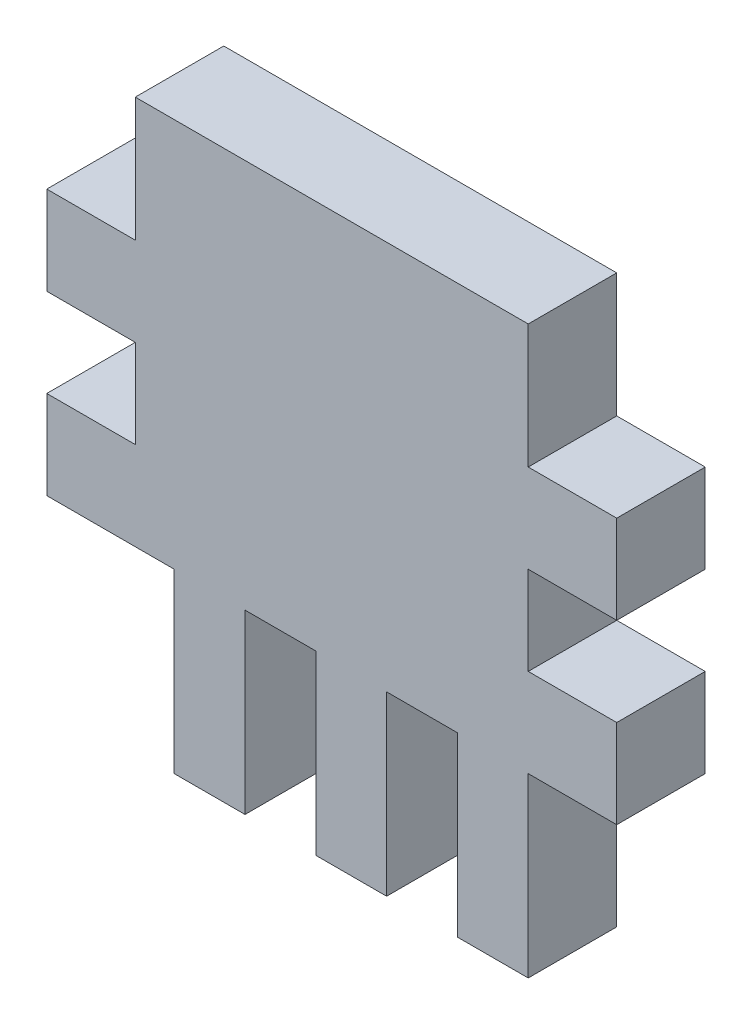
ISO-10303-21;
HEADER;
FILE_DESCRIPTION(('STEP AP214'),'2;1');
FILE_NAME('part.step','',(''),(''),'','','');
FILE_SCHEMA(('AUTOMOTIVE_DESIGN { 1 0 10303 214 1 1 1 1 }'));
ENDSEC;
DATA;
#1=APPLICATION_CONTEXT('core data for automotive mechanical design processes');
#2=APPLICATION_PROTOCOL_DEFINITION('international standard','automotive_design',2000,#1);
#3=PRODUCT_CONTEXT('',#1,'mechanical');
#4=PRODUCT('Part','Part','',(#3));
#5=PRODUCT_RELATED_PRODUCT_CATEGORY('part','',(#4));
#6=PRODUCT_DEFINITION_FORMATION('','',#4);
#7=PRODUCT_DEFINITION_CONTEXT('part definition',#1,'design');
#8=PRODUCT_DEFINITION('design','',#6,#7);
#9=PRODUCT_DEFINITION_SHAPE('','',#8);
#10=(LENGTH_UNIT() NAMED_UNIT(*) SI_UNIT(.MILLI.,.METRE.));
#11=(NAMED_UNIT(*) PLANE_ANGLE_UNIT() SI_UNIT($,.RADIAN.));
#12=(NAMED_UNIT(*) SI_UNIT($,.STERADIAN.) SOLID_ANGLE_UNIT());
#13=UNCERTAINTY_MEASURE_WITH_UNIT(LENGTH_MEASURE(1.E-05),#10,'distance_accuracy_value','');
#14=(GEOMETRIC_REPRESENTATION_CONTEXT(3) GLOBAL_UNCERTAINTY_ASSIGNED_CONTEXT((#13)) GLOBAL_UNIT_ASSIGNED_CONTEXT((#10,
#11,#12)) REPRESENTATION_CONTEXT('',''));
#15=CARTESIAN_POINT('',(0.,0.,0.));
#16=DIRECTION('',(0.,0.,1.));
#17=DIRECTION('',(1.,0.,0.));
#18=AXIS2_PLACEMENT_3D('',#15,#16,#17);
#19=CARTESIAN_POINT('',(7.56053151531805,0.,5.));
#20=DIRECTION('',(1.,0.,0.));
#21=DIRECTION('',(0.,1.,0.));
#22=AXIS2_PLACEMENT_3D('',#19,#20,#21);
#23=PLANE('',#22);
#24=DIRECTION('',(0.,-1.,0.));
#25=VECTOR('',#24,1.);
#26=CARTESIAN_POINT('',(7.56053151531805,0.,0.));
#27=LINE('',#26,#25);
#28=CARTESIAN_POINT('',(7.56053151531805,-1.21306122857178,0.));
#29=VERTEX_POINT('',#28);
#30=CARTESIAN_POINT('',(7.56053151531805,-11.2130612285718,0.));
#31=VERTEX_POINT('',#30);
#32=EDGE_CURVE('E450',#29,#31,#27,.T.);
#33=ORIENTED_EDGE('',*,*,#32,.F.);
#34=DIRECTION('',(0.,0.,-1.));
#35=VECTOR('',#34,1.);
#36=CARTESIAN_POINT('',(7.56053151531805,-1.21306122857178,5.));
#37=LINE('',#36,#35);
#38=CARTESIAN_POINT('',(7.56053151531805,-1.21306122857178,5.));
#39=VERTEX_POINT('',#38);
#40=EDGE_CURVE('E405',#39,#29,#37,.T.);
#41=ORIENTED_EDGE('',*,*,#40,.F.);
#42=DIRECTION('',(0.,-1.,0.));
#43=VECTOR('',#42,1.);
#44=CARTESIAN_POINT('',(7.56053151531805,0.,5.));
#45=LINE('',#44,#43);
#46=CARTESIAN_POINT('',(7.56053151531805,-11.2130612285718,5.));
#47=VERTEX_POINT('',#46);
#48=EDGE_CURVE('E526',#39,#47,#45,.T.);
#49=ORIENTED_EDGE('',*,*,#48,.T.);
#50=DIRECTION('',(0.,0.,-1.));
#51=VECTOR('',#50,1.);
#52=CARTESIAN_POINT('',(7.56053151531805,-11.2130612285718,5.));
#53=LINE('',#52,#51);
#54=EDGE_CURVE('E407',#47,#31,#53,.T.);
#55=ORIENTED_EDGE('',*,*,#54,.T.);
#56=EDGE_LOOP('',(#33,#41,#49,#55));
#57=FACE_BOUND('',#56,.T.);
#58=ADVANCED_FACE('F130',(#57),#23,.T.);
#59=CARTESIAN_POINT('',(0.,-11.2130612285718,5.));
#60=DIRECTION('',(0.,1.,0.));
#61=DIRECTION('',(0.,0.,1.));
#62=AXIS2_PLACEMENT_3D('',#59,#60,#61);
#63=PLANE('',#62);
#64=DIRECTION('',(1.,0.,0.));
#65=VECTOR('',#64,1.);
#66=CARTESIAN_POINT('',(0.,-11.2130612285718,0.));
#67=LINE('',#66,#65);
#68=CARTESIAN_POINT('',(3.56053151531805,-11.2130612285718,0.));
#69=VERTEX_POINT('',#68);
#70=EDGE_CURVE('E447',#69,#31,#67,.T.);
#71=ORIENTED_EDGE('',*,*,#70,.T.);
#72=ORIENTED_EDGE('',*,*,#54,.F.);
#73=DIRECTION('',(1.,0.,0.));
#74=VECTOR('',#73,1.);
#75=CARTESIAN_POINT('',(0.,-11.2130612285718,5.));
#76=LINE('',#75,#74);
#77=CARTESIAN_POINT('',(3.56053151531805,-11.2130612285718,5.));
#78=VERTEX_POINT('',#77);
#79=EDGE_CURVE('E529',#78,#47,#76,.T.);
#80=ORIENTED_EDGE('',*,*,#79,.F.);
#81=DIRECTION('',(0.,0.,-1.));
#82=VECTOR('',#81,1.);
#83=CARTESIAN_POINT('',(3.56053151531805,-11.2130612285718,5.));
#84=LINE('',#83,#82);
#85=EDGE_CURVE('E409',#78,#69,#84,.T.);
#86=ORIENTED_EDGE('',*,*,#85,.T.);
#87=EDGE_LOOP('',(#71,#72,#80,#86));
#88=FACE_BOUND('',#87,.T.);
#89=ADVANCED_FACE('F558',(#88),#63,.F.);
#90=CARTESIAN_POINT('',(3.56053151531805,0.,5.));
#91=DIRECTION('',(1.,0.,0.));
#92=DIRECTION('',(0.,1.,0.));
#93=AXIS2_PLACEMENT_3D('',#90,#91,#92);
#94=PLANE('',#93);
#95=DIRECTION('',(0.,-1.,0.));
#96=VECTOR('',#95,1.);
#97=CARTESIAN_POINT('',(3.56053151531805,0.,0.));
#98=LINE('',#97,#96);
#99=CARTESIAN_POINT('',(3.56053151531805,-1.21306122857178,0.));
#100=VERTEX_POINT('',#99);
#101=EDGE_CURVE('E443',#100,#69,#98,.T.);
#102=ORIENTED_EDGE('',*,*,#101,.T.);
#103=ORIENTED_EDGE('',*,*,#85,.F.);
#104=DIRECTION('',(0.,-1.,0.));
#105=VECTOR('',#104,1.);
#106=CARTESIAN_POINT('',(3.56053151531805,0.,5.));
#107=LINE('',#106,#105);
#108=CARTESIAN_POINT('',(3.56053151531805,-1.21306122857178,5.));
#109=VERTEX_POINT('',#108);
#110=EDGE_CURVE('E531',#109,#78,#107,.T.);
#111=ORIENTED_EDGE('',*,*,#110,.F.);
#112=DIRECTION('',(0.,0.,-1.));
#113=VECTOR('',#112,1.);
#114=CARTESIAN_POINT('',(3.56053151531805,-1.21306122857178,5.));
#115=LINE('',#114,#113);
#116=EDGE_CURVE('E412',#109,#100,#115,.T.);
#117=ORIENTED_EDGE('',*,*,#116,.T.);
#118=EDGE_LOOP('',(#102,#103,#111,#117));
#119=FACE_BOUND('',#118,.T.);
#120=ADVANCED_FACE('F552',(#119),#94,.F.);
#121=CARTESIAN_POINT('',(11.5605315153181,0.,5.));
#122=DIRECTION('',(1.,0.,0.));
#123=DIRECTION('',(0.,1.,0.));
#124=AXIS2_PLACEMENT_3D('',#121,#122,#123);
#125=PLANE('',#124);
#126=DIRECTION('',(0.,-1.,0.));
#127=VECTOR('',#126,1.);
#128=CARTESIAN_POINT('',(11.5605315153181,0.,0.));
#129=LINE('',#128,#127);
#130=CARTESIAN_POINT('',(11.5605315153181,-1.21306122857178,0.));
#131=VERTEX_POINT('',#130);
#132=CARTESIAN_POINT('',(11.5605315153181,-11.2130612285718,0.));
#133=VERTEX_POINT('',#132);
#134=EDGE_CURVE('E453',#131,#133,#129,.T.);
#135=ORIENTED_EDGE('',*,*,#134,.T.);
#136=DIRECTION('',(0.,0.,-1.));
#137=VECTOR('',#136,1.);
#138=CARTESIAN_POINT('',(11.5605315153181,-11.2130612285718,5.));
#139=LINE('',#138,#137);
#140=CARTESIAN_POINT('',(11.5605315153181,-11.2130612285718,5.));
#141=VERTEX_POINT('',#140);
#142=EDGE_CURVE('E399',#141,#133,#139,.T.);
#143=ORIENTED_EDGE('',*,*,#142,.F.);
#144=DIRECTION('',(0.,-1.,0.));
#145=VECTOR('',#144,1.);
#146=CARTESIAN_POINT('',(11.5605315153181,0.,5.));
#147=LINE('',#146,#145);
#148=CARTESIAN_POINT('',(11.5605315153181,-1.21306122857178,5.));
#149=VERTEX_POINT('',#148);
#150=EDGE_CURVE('E523',#149,#141,#147,.T.);
#151=ORIENTED_EDGE('',*,*,#150,.F.);
#152=DIRECTION('',(0.,0.,-1.));
#153=VECTOR('',#152,1.);
#154=CARTESIAN_POINT('',(11.5605315153181,-1.21306122857178,5.));
#155=LINE('',#154,#153);
#156=EDGE_CURVE('E402',#149,#131,#155,.T.);
#157=ORIENTED_EDGE('',*,*,#156,.T.);
#158=EDGE_LOOP('',(#135,#143,#151,#157));
#159=FACE_BOUND('',#158,.T.);
#160=ADVANCED_FACE('F625',(#159),#125,.F.);
#161=CARTESIAN_POINT('',(0.,-11.2130612285718,5.));
#162=DIRECTION('',(0.,1.,0.));
#163=DIRECTION('',(0.,0.,1.));
#164=AXIS2_PLACEMENT_3D('',#161,#162,#163);
#165=PLANE('',#164);
#166=DIRECTION('',(1.,0.,0.));
#167=VECTOR('',#166,1.);
#168=CARTESIAN_POINT('',(0.,-11.2130612285718,0.));
#169=LINE('',#168,#167);
#170=CARTESIAN_POINT('',(15.5605315153181,-11.2130612285718,0.));
#171=VERTEX_POINT('',#170);
#172=EDGE_CURVE('E455',#133,#171,#169,.T.);
#173=ORIENTED_EDGE('',*,*,#172,.T.);
#174=DIRECTION('',(0.,0.,-1.));
#175=VECTOR('',#174,1.);
#176=CARTESIAN_POINT('',(15.5605315153181,-11.2130612285718,5.));
#177=LINE('',#176,#175);
#178=CARTESIAN_POINT('',(15.5605315153181,-11.2130612285718,5.));
#179=VERTEX_POINT('',#178);
#180=EDGE_CURVE('E397',#179,#171,#177,.T.);
#181=ORIENTED_EDGE('',*,*,#180,.F.);
#182=DIRECTION('',(1.,0.,0.));
#183=VECTOR('',#182,1.);
#184=CARTESIAN_POINT('',(0.,-11.2130612285718,5.));
#185=LINE('',#184,#183);
#186=EDGE_CURVE('E521',#141,#179,#185,.T.);
#187=ORIENTED_EDGE('',*,*,#186,.F.);
#188=ORIENTED_EDGE('',*,*,#142,.T.);
#189=EDGE_LOOP('',(#173,#181,#187,#188));
#190=FACE_BOUND('',#189,.T.);
#191=ADVANCED_FACE('F627',(#190),#165,.F.);
#192=CARTESIAN_POINT('',(15.5605315153181,0.,5.));
#193=DIRECTION('',(1.,0.,0.));
#194=DIRECTION('',(0.,1.,0.));
#195=AXIS2_PLACEMENT_3D('',#192,#193,#194);
#196=PLANE('',#195);
#197=DIRECTION('',(0.,-1.,0.));
#198=VECTOR('',#197,1.);
#199=CARTESIAN_POINT('',(15.5605315153181,0.,0.));
#200=LINE('',#199,#198);
#201=CARTESIAN_POINT('',(15.5605315153181,-1.21306122857178,0.));
#202=VERTEX_POINT('',#201);
#203=EDGE_CURVE('E458',#202,#171,#200,.T.);
#204=ORIENTED_EDGE('',*,*,#203,.F.);
#205=DIRECTION('',(0.,0.,-1.));
#206=VECTOR('',#205,1.);
#207=CARTESIAN_POINT('',(15.5605315153181,-1.21306122857178,5.));
#208=LINE('',#207,#206);
#209=CARTESIAN_POINT('',(15.5605315153181,-1.21306122857178,5.));
#210=VERTEX_POINT('',#209);
#211=EDGE_CURVE('E395',#210,#202,#208,.T.);
#212=ORIENTED_EDGE('',*,*,#211,.F.);
#213=DIRECTION('',(0.,-1.,0.));
#214=VECTOR('',#213,1.);
#215=CARTESIAN_POINT('',(15.5605315153181,0.,5.));
#216=LINE('',#215,#214);
#217=EDGE_CURVE('E518',#210,#179,#216,.T.);
#218=ORIENTED_EDGE('',*,*,#217,.T.);
#219=ORIENTED_EDGE('',*,*,#180,.T.);
#220=EDGE_LOOP('',(#204,#212,#218,#219));
#221=FACE_BOUND('',#220,.T.);
#222=ADVANCED_FACE('F634',(#221),#196,.T.);
#223=CARTESIAN_POINT('',(0.,-1.21306122857178,5.));
#224=DIRECTION('',(0.,1.,0.));
#225=DIRECTION('',(0.,0.,1.));
#226=AXIS2_PLACEMENT_3D('',#223,#224,#225);
#227=PLANE('',#226);
#228=DIRECTION('',(1.,0.,0.));
#229=VECTOR('',#228,1.);
#230=CARTESIAN_POINT('',(0.,-1.21306122857178,0.));
#231=LINE('',#230,#229);
#232=CARTESIAN_POINT('',(19.5605315153181,-1.21306122857178,0.));
#233=VERTEX_POINT('',#232);
#234=EDGE_CURVE('E444',#202,#233,#231,.T.);
#235=ORIENTED_EDGE('',*,*,#234,.T.);
#236=DIRECTION('',(0.,0.,-1.));
#237=VECTOR('',#236,1.);
#238=CARTESIAN_POINT('',(19.5605315153181,-1.21306122857178,5.));
#239=LINE('',#238,#237);
#240=CARTESIAN_POINT('',(19.5605315153181,-1.21306122857178,5.));
#241=VERTEX_POINT('',#240);
#242=EDGE_CURVE('E392',#241,#233,#239,.T.);
#243=ORIENTED_EDGE('',*,*,#242,.F.);
#244=DIRECTION('',(1.,0.,0.));
#245=VECTOR('',#244,1.);
#246=CARTESIAN_POINT('',(0.,-1.21306122857178,5.));
#247=LINE('',#246,#245);
#248=EDGE_CURVE('E517',#210,#241,#247,.T.);
#249=ORIENTED_EDGE('',*,*,#248,.F.);
#250=ORIENTED_EDGE('',*,*,#211,.T.);
#251=EDGE_LOOP('',(#235,#243,#249,#250));
#252=FACE_BOUND('',#251,.T.);
#253=ADVANCED_FACE('F573',(#252),#227,.F.);
#254=CARTESIAN_POINT('',(19.5605315153181,0.,5.));
#255=DIRECTION('',(1.,0.,0.));
#256=DIRECTION('',(0.,0.,-1.));
#257=AXIS2_PLACEMENT_3D('',#254,#255,#256);
#258=PLANE('',#257);
#259=DIRECTION('',(0.,-1.,0.));
#260=VECTOR('',#259,1.);
#261=CARTESIAN_POINT('',(19.5605315153181,0.,0.));
#262=LINE('',#261,#260);
#263=CARTESIAN_POINT('',(19.5605315153181,-11.2130612285718,0.));
#264=VERTEX_POINT('',#263);
#265=EDGE_CURVE('E461',#233,#264,#262,.T.);
#266=ORIENTED_EDGE('',*,*,#265,.T.);
#267=DIRECTION('',(0.,0.,-1.));
#268=VECTOR('',#267,1.);
#269=CARTESIAN_POINT('',(19.5605315153181,-11.2130612285718,5.));
#270=LINE('',#269,#268);
#271=CARTESIAN_POINT('',(19.5605315153181,-11.2130612285718,5.));
#272=VERTEX_POINT('',#271);
#273=EDGE_CURVE('E390',#272,#264,#270,.T.);
#274=ORIENTED_EDGE('',*,*,#273,.F.);
#275=DIRECTION('',(0.,-1.,0.));
#276=VECTOR('',#275,1.);
#277=CARTESIAN_POINT('',(19.5605315153181,0.,5.));
#278=LINE('',#277,#276);
#279=EDGE_CURVE('E515',#241,#272,#278,.T.);
#280=ORIENTED_EDGE('',*,*,#279,.F.);
#281=ORIENTED_EDGE('',*,*,#242,.T.);
#282=EDGE_LOOP('',(#266,#274,#280,#281));
#283=FACE_BOUND('',#282,.T.);
#284=ADVANCED_FACE('F577',(#283),#258,.F.);
#285=CARTESIAN_POINT('',(0.,-11.2130612285718,5.));
#286=DIRECTION('',(0.,-1.,0.));
#287=DIRECTION('',(1.,0.,0.));
#288=AXIS2_PLACEMENT_3D('',#285,#286,#287);
#289=PLANE('',#288);
#290=DIRECTION('',(-1.,0.,0.));
#291=VECTOR('',#290,1.);
#292=CARTESIAN_POINT('',(0.,-11.2130612285718,0.));
#293=LINE('',#292,#291);
#294=CARTESIAN_POINT('',(23.5605315153181,-11.2130612285718,0.));
#295=VERTEX_POINT('',#294);
#296=EDGE_CURVE('E464',#295,#264,#293,.T.);
#297=ORIENTED_EDGE('',*,*,#296,.F.);
#298=DIRECTION('',(0.,0.,-1.));
#299=VECTOR('',#298,1.);
#300=CARTESIAN_POINT('',(23.5605315153181,-11.2130612285718,5.));
#301=LINE('',#300,#299);
#302=CARTESIAN_POINT('',(23.5605315153181,-11.2130612285718,5.));
#303=VERTEX_POINT('',#302);
#304=EDGE_CURVE('E388',#303,#295,#301,.T.);
#305=ORIENTED_EDGE('',*,*,#304,.F.);
#306=DIRECTION('',(-1.,0.,0.));
#307=VECTOR('',#306,1.);
#308=CARTESIAN_POINT('',(0.,-11.2130612285718,5.));
#309=LINE('',#308,#307);
#310=EDGE_CURVE('E512',#303,#272,#309,.T.);
#311=ORIENTED_EDGE('',*,*,#310,.T.);
#312=ORIENTED_EDGE('',*,*,#273,.T.);
#313=EDGE_LOOP('',(#297,#305,#311,#312));
#314=FACE_BOUND('',#313,.T.);
#315=ADVANCED_FACE('F580',(#314),#289,.T.);
#316=CARTESIAN_POINT('',(23.5605315153181,0.,5.));
#317=DIRECTION('',(1.,0.,0.));
#318=DIRECTION('',(0.,0.,-1.));
#319=AXIS2_PLACEMENT_3D('',#316,#317,#318);
#320=PLANE('',#319);
#321=DIRECTION('',(0.,-1.,0.));
#322=VECTOR('',#321,1.);
#323=CARTESIAN_POINT('',(23.5605315153181,0.,0.));
#324=LINE('',#323,#322);
#325=CARTESIAN_POINT('',(23.5605315153181,-1.21306122857178,0.));
#326=VERTEX_POINT('',#325);
#327=EDGE_CURVE('E467',#326,#295,#324,.T.);
#328=ORIENTED_EDGE('',*,*,#327,.F.);
#329=DIRECTION('',(0.,0.,-1.));
#330=VECTOR('',#329,1.);
#331=CARTESIAN_POINT('',(23.5605315153181,-1.21306122857178,5.));
#332=LINE('',#331,#330);
#333=CARTESIAN_POINT('',(23.5605315153181,-1.21306122857178,5.));
#334=VERTEX_POINT('',#333);
#335=EDGE_CURVE('E386',#334,#326,#332,.T.);
#336=ORIENTED_EDGE('',*,*,#335,.F.);
#337=DIRECTION('',(0.,-1.,0.));
#338=VECTOR('',#337,1.);
#339=CARTESIAN_POINT('',(23.5605315153181,0.,5.));
#340=LINE('',#339,#338);
#341=EDGE_CURVE('E509',#334,#303,#340,.T.);
#342=ORIENTED_EDGE('',*,*,#341,.T.);
#343=ORIENTED_EDGE('',*,*,#304,.T.);
#344=EDGE_LOOP('',(#328,#336,#342,#343));
#345=FACE_BOUND('',#344,.T.);
#346=ADVANCED_FACE('F584',(#345),#320,.T.);
#347=CARTESIAN_POINT('',(0.,-1.21306122857178,5.));
#348=DIRECTION('',(0.,1.,0.));
#349=DIRECTION('',(0.,0.,1.));
#350=AXIS2_PLACEMENT_3D('',#347,#348,#349);
#351=PLANE('',#350);
#352=DIRECTION('',(1.,0.,0.));
#353=VECTOR('',#352,1.);
#354=CARTESIAN_POINT('',(0.,-1.21306122857178,0.));
#355=LINE('',#354,#353);
#356=CARTESIAN_POINT('',(28.5605315153181,-1.21306122857178,0.));
#357=VERTEX_POINT('',#356);
#358=EDGE_CURVE('E470',#326,#357,#355,.T.);
#359=ORIENTED_EDGE('',*,*,#358,.T.);
#360=DIRECTION('',(0.,0.,-1.));
#361=VECTOR('',#360,1.);
#362=CARTESIAN_POINT('',(28.5605315153181,-1.21306122857178,5.));
#363=LINE('',#362,#361);
#364=CARTESIAN_POINT('',(28.5605315153181,-1.21306122857178,5.));
#365=VERTEX_POINT('',#364);
#366=EDGE_CURVE('E383',#365,#357,#363,.T.);
#367=ORIENTED_EDGE('',*,*,#366,.F.);
#368=DIRECTION('',(1.,0.,0.));
#369=VECTOR('',#368,1.);
#370=CARTESIAN_POINT('',(0.,-1.21306122857178,5.));
#371=LINE('',#370,#369);
#372=EDGE_CURVE('E507',#334,#365,#371,.T.);
#373=ORIENTED_EDGE('',*,*,#372,.F.);
#374=ORIENTED_EDGE('',*,*,#335,.T.);
#375=EDGE_LOOP('',(#359,#367,#373,#374));
#376=FACE_BOUND('',#375,.T.);
#377=ADVANCED_FACE('F589',(#376),#351,.F.);
#378=CARTESIAN_POINT('',(28.5605315153181,0.,5.));
#379=DIRECTION('',(-1.,0.,0.));
#380=DIRECTION('',(0.,0.,1.));
#381=AXIS2_PLACEMENT_3D('',#378,#379,#380);
#382=PLANE('',#381);
#383=DIRECTION('',(0.,1.,0.));
#384=VECTOR('',#383,1.);
#385=CARTESIAN_POINT('',(28.5605315153181,0.,0.));
#386=LINE('',#385,#384);
#387=CARTESIAN_POINT('',(28.5605315153181,3.78693877142822,0.));
#388=VERTEX_POINT('',#387);
#389=EDGE_CURVE('E472',#357,#388,#386,.T.);
#390=ORIENTED_EDGE('',*,*,#389,.T.);
#391=DIRECTION('',(0.,0.,-1.));
#392=VECTOR('',#391,1.);
#393=CARTESIAN_POINT('',(28.5605315153181,3.78693877142822,5.));
#394=LINE('',#393,#392);
#395=CARTESIAN_POINT('',(28.5605315153181,3.78693877142822,5.));
#396=VERTEX_POINT('',#395);
#397=EDGE_CURVE('E381',#396,#388,#394,.T.);
#398=ORIENTED_EDGE('',*,*,#397,.F.);
#399=DIRECTION('',(0.,1.,0.));
#400=VECTOR('',#399,1.);
#401=CARTESIAN_POINT('',(28.5605315153181,0.,5.));
#402=LINE('',#401,#400);
#403=EDGE_CURVE('E505',#365,#396,#402,.T.);
#404=ORIENTED_EDGE('',*,*,#403,.F.);
#405=ORIENTED_EDGE('',*,*,#366,.T.);
#406=EDGE_LOOP('',(#390,#398,#404,#405));
#407=FACE_BOUND('',#406,.T.);
#408=ADVANCED_FACE('F594',(#407),#382,.F.);
#409=CARTESIAN_POINT('',(0.,3.78693877142822,5.));
#410=DIRECTION('',(0.,1.,0.));
#411=DIRECTION('',(0.,0.,1.));
#412=AXIS2_PLACEMENT_3D('',#409,#410,#411);
#413=PLANE('',#412);
#414=DIRECTION('',(1.,0.,0.));
#415=VECTOR('',#414,1.);
#416=CARTESIAN_POINT('',(0.,3.78693877142822,0.));
#417=LINE('',#416,#415);
#418=CARTESIAN_POINT('',(23.5605315153181,3.78693877142822,0.));
#419=VERTEX_POINT('',#418);
#420=EDGE_CURVE('E475',#419,#388,#417,.T.);
#421=ORIENTED_EDGE('',*,*,#420,.F.);
#422=DIRECTION('',(0.,0.,-1.));
#423=VECTOR('',#422,1.);
#424=CARTESIAN_POINT('',(23.5605315153181,3.78693877142822,5.));
#425=LINE('',#424,#423);
#426=CARTESIAN_POINT('',(23.5605315153181,3.78693877142822,5.));
#427=VERTEX_POINT('',#426);
#428=EDGE_CURVE('E379',#427,#419,#425,.T.);
#429=ORIENTED_EDGE('',*,*,#428,.F.);
#430=DIRECTION('',(1.,0.,0.));
#431=VECTOR('',#430,1.);
#432=CARTESIAN_POINT('',(0.,3.78693877142822,5.));
#433=LINE('',#432,#431);
#434=EDGE_CURVE('E502',#427,#396,#433,.T.);
#435=ORIENTED_EDGE('',*,*,#434,.T.);
#436=ORIENTED_EDGE('',*,*,#397,.T.);
#437=EDGE_LOOP('',(#421,#429,#435,#436));
#438=FACE_BOUND('',#437,.T.);
#439=ADVANCED_FACE('F598',(#438),#413,.T.);
#440=CARTESIAN_POINT('',(23.5605315153181,0.,5.));
#441=DIRECTION('',(-1.,0.,0.));
#442=DIRECTION('',(0.,0.,1.));
#443=AXIS2_PLACEMENT_3D('',#440,#441,#442);
#444=PLANE('',#443);
#445=DIRECTION('',(0.,1.,0.));
#446=VECTOR('',#445,1.);
#447=CARTESIAN_POINT('',(23.5605315153181,0.,0.));
#448=LINE('',#447,#446);
#449=CARTESIAN_POINT('',(23.5605315153181,8.78693877142822,0.));
#450=VERTEX_POINT('',#449);
#451=EDGE_CURVE('E478',#419,#450,#448,.T.);
#452=ORIENTED_EDGE('',*,*,#451,.T.);
#453=DIRECTION('',(0.,0.,-1.));
#454=VECTOR('',#453,1.);
#455=CARTESIAN_POINT('',(23.5605315153181,8.78693877142822,5.));
#456=LINE('',#455,#454);
#457=CARTESIAN_POINT('',(23.5605315153181,8.78693877142822,5.));
#458=VERTEX_POINT('',#457);
#459=EDGE_CURVE('E376',#458,#450,#456,.T.);
#460=ORIENTED_EDGE('',*,*,#459,.F.);
#461=DIRECTION('',(0.,1.,0.));
#462=VECTOR('',#461,1.);
#463=CARTESIAN_POINT('',(23.5605315153181,0.,5.));
#464=LINE('',#463,#462);
#465=EDGE_CURVE('E500',#427,#458,#464,.T.);
#466=ORIENTED_EDGE('',*,*,#465,.F.);
#467=ORIENTED_EDGE('',*,*,#428,.T.);
#468=EDGE_LOOP('',(#452,#460,#466,#467));
#469=FACE_BOUND('',#468,.T.);
#470=ADVANCED_FACE('F603',(#469),#444,.F.);
#471=CARTESIAN_POINT('',(0.,8.78693877142822,5.));
#472=DIRECTION('',(0.,1.,0.));
#473=DIRECTION('',(0.,0.,1.));
#474=AXIS2_PLACEMENT_3D('',#471,#472,#473);
#475=PLANE('',#474);
#476=DIRECTION('',(1.,0.,0.));
#477=VECTOR('',#476,1.);
#478=CARTESIAN_POINT('',(0.,8.78693877142822,0.));
#479=LINE('',#478,#477);
#480=CARTESIAN_POINT('',(28.5605315153181,8.78693877142822,0.));
#481=VERTEX_POINT('',#480);
#482=EDGE_CURVE('E480',#450,#481,#479,.T.);
#483=ORIENTED_EDGE('',*,*,#482,.T.);
#484=DIRECTION('',(0.,0.,-1.));
#485=VECTOR('',#484,1.);
#486=CARTESIAN_POINT('',(28.5605315153181,8.78693877142822,5.));
#487=LINE('',#486,#485);
#488=CARTESIAN_POINT('',(28.5605315153181,8.78693877142822,5.));
#489=VERTEX_POINT('',#488);
#490=EDGE_CURVE('E373',#489,#481,#487,.T.);
#491=ORIENTED_EDGE('',*,*,#490,.F.);
#492=DIRECTION('',(1.,0.,0.));
#493=VECTOR('',#492,1.);
#494=CARTESIAN_POINT('',(0.,8.78693877142822,5.));
#495=LINE('',#494,#493);
#496=EDGE_CURVE('E498',#458,#489,#495,.T.);
#497=ORIENTED_EDGE('',*,*,#496,.F.);
#498=ORIENTED_EDGE('',*,*,#459,.T.);
#499=EDGE_LOOP('',(#483,#491,#497,#498));
#500=FACE_BOUND('',#499,.T.);
#501=ADVANCED_FACE('F609',(#500),#475,.F.);
#502=CARTESIAN_POINT('',(28.5605315153181,0.,5.));
#503=DIRECTION('',(-1.,0.,0.));
#504=DIRECTION('',(0.,0.,1.));
#505=AXIS2_PLACEMENT_3D('',#502,#503,#504);
#506=PLANE('',#505);
#507=DIRECTION('',(0.,1.,0.));
#508=VECTOR('',#507,1.);
#509=CARTESIAN_POINT('',(28.5605315153181,0.,0.));
#510=LINE('',#509,#508);
#511=CARTESIAN_POINT('',(28.5605315153181,13.7869387714282,0.));
#512=VERTEX_POINT('',#511);
#513=EDGE_CURVE('E483',#481,#512,#510,.T.);
#514=ORIENTED_EDGE('',*,*,#513,.T.);
#515=DIRECTION('',(0.,0.,-1.));
#516=VECTOR('',#515,1.);
#517=CARTESIAN_POINT('',(28.5605315153181,13.7869387714282,5.));
#518=LINE('',#517,#516);
#519=CARTESIAN_POINT('',(28.5605315153181,13.7869387714282,5.));
#520=VERTEX_POINT('',#519);
#521=EDGE_CURVE('E371',#520,#512,#518,.T.);
#522=ORIENTED_EDGE('',*,*,#521,.F.);
#523=DIRECTION('',(0.,1.,0.));
#524=VECTOR('',#523,1.);
#525=CARTESIAN_POINT('',(28.5605315153181,0.,5.));
#526=LINE('',#525,#524);
#527=EDGE_CURVE('E496',#489,#520,#526,.T.);
#528=ORIENTED_EDGE('',*,*,#527,.F.);
#529=ORIENTED_EDGE('',*,*,#490,.T.);
#530=EDGE_LOOP('',(#514,#522,#528,#529));
#531=FACE_BOUND('',#530,.T.);
#532=ADVANCED_FACE('F612',(#531),#506,.F.);
#533=CARTESIAN_POINT('',(0.,13.7869387714282,5.));
#534=DIRECTION('',(0.,1.,0.));
#535=DIRECTION('',(0.,0.,1.));
#536=AXIS2_PLACEMENT_3D('',#533,#534,#535);
#537=PLANE('',#536);
#538=DIRECTION('',(1.,0.,0.));
#539=VECTOR('',#538,1.);
#540=CARTESIAN_POINT('',(0.,13.7869387714282,0.));
#541=LINE('',#540,#539);
#542=CARTESIAN_POINT('',(23.5605315153181,13.7869387714282,0.));
#543=VERTEX_POINT('',#542);
#544=EDGE_CURVE('E485',#543,#512,#541,.T.);
#545=ORIENTED_EDGE('',*,*,#544,.F.);
#546=DIRECTION('',(0.,0.,-1.));
#547=VECTOR('',#546,1.);
#548=CARTESIAN_POINT('',(23.5605315153181,13.7869387714282,5.));
#549=LINE('',#548,#547);
#550=CARTESIAN_POINT('',(23.5605315153181,13.7869387714282,5.));
#551=VERTEX_POINT('',#550);
#552=EDGE_CURVE('E369',#551,#543,#549,.T.);
#553=ORIENTED_EDGE('',*,*,#552,.F.);
#554=DIRECTION('',(1.,0.,0.));
#555=VECTOR('',#554,1.);
#556=CARTESIAN_POINT('',(0.,13.7869387714282,5.));
#557=LINE('',#556,#555);
#558=EDGE_CURVE('E493',#551,#520,#557,.T.);
#559=ORIENTED_EDGE('',*,*,#558,.T.);
#560=ORIENTED_EDGE('',*,*,#521,.T.);
#561=EDGE_LOOP('',(#545,#553,#559,#560));
#562=FACE_BOUND('',#561,.T.);
#563=ADVANCED_FACE('F614',(#562),#537,.T.);
#564=CARTESIAN_POINT('',(23.5605315153181,20.7869387714282,0.));
#565=VERTEX_POINT('',#564);
#566=EDGE_CURVE('E481',#543,#565,#448,.T.);
#567=ORIENTED_EDGE('',*,*,#566,.T.);
#568=DIRECTION('',(0.,0.,-1.));
#569=VECTOR('',#568,1.);
#570=CARTESIAN_POINT('',(23.5605315153181,20.7869387714282,5.));
#571=LINE('',#570,#569);
#572=CARTESIAN_POINT('',(23.5605315153181,20.7869387714282,5.));
#573=VERTEX_POINT('',#572);
#574=EDGE_CURVE('E330',#573,#565,#571,.T.);
#575=ORIENTED_EDGE('',*,*,#574,.F.);
#576=EDGE_CURVE('E337',#551,#573,#464,.T.);
#577=ORIENTED_EDGE('',*,*,#576,.F.);
#578=ORIENTED_EDGE('',*,*,#552,.T.);
#579=EDGE_LOOP('',(#567,#575,#577,#578));
#580=FACE_BOUND('',#579,.T.);
#581=ADVANCED_FACE('F615',(#580),#444,.F.);
#582=CARTESIAN_POINT('',(0.,20.7869387714282,5.));
#583=DIRECTION('',(0.,1.,0.));
#584=DIRECTION('',(-1.,0.,0.));
#585=AXIS2_PLACEMENT_3D('',#582,#583,#584);
#586=PLANE('',#585);
#587=DIRECTION('',(1.,0.,0.));
#588=VECTOR('',#587,1.);
#589=CARTESIAN_POINT('',(0.,20.7869387714282,0.));
#590=LINE('',#589,#588);
#591=CARTESIAN_POINT('',(1.36053151531805,20.7869387714282,0.));
#592=VERTEX_POINT('',#591);
#593=EDGE_CURVE('E325',#592,#565,#590,.T.);
#594=ORIENTED_EDGE('',*,*,#593,.F.);
#595=DIRECTION('',(0.,0.,-1.));
#596=VECTOR('',#595,1.);
#597=CARTESIAN_POINT('',(1.36053151531805,20.7869387714282,5.));
#598=LINE('',#597,#596);
#599=CARTESIAN_POINT('',(1.36053151531805,20.7869387714282,5.));
#600=VERTEX_POINT('',#599);
#601=EDGE_CURVE('E320',#600,#592,#598,.T.);
#602=ORIENTED_EDGE('',*,*,#601,.F.);
#603=DIRECTION('',(1.,0.,0.));
#604=VECTOR('',#603,1.);
#605=CARTESIAN_POINT('',(0.,20.7869387714282,5.));
#606=LINE('',#605,#604);
#607=EDGE_CURVE('E323',#600,#573,#606,.T.);
#608=ORIENTED_EDGE('',*,*,#607,.T.);
#609=ORIENTED_EDGE('',*,*,#574,.T.);
#610=EDGE_LOOP('',(#594,#602,#608,#609));
#611=FACE_BOUND('',#610,.T.);
#612=ADVANCED_FACE('F322',(#611),#586,.T.);
#613=CARTESIAN_POINT('',(1.36053151531805,0.,5.));
#614=DIRECTION('',(-1.,0.,0.));
#615=DIRECTION('',(0.,0.,1.));
#616=AXIS2_PLACEMENT_3D('',#613,#614,#615);
#617=PLANE('',#616);
#618=DIRECTION('',(0.,1.,0.));
#619=VECTOR('',#618,1.);
#620=CARTESIAN_POINT('',(1.36053151531805,0.,0.));
#621=LINE('',#620,#619);
#622=CARTESIAN_POINT('',(1.36053151531805,13.7869387714282,0.));
#623=VERTEX_POINT('',#622);
#624=EDGE_CURVE('E358',#623,#592,#621,.T.);
#625=ORIENTED_EDGE('',*,*,#624,.F.);
#626=DIRECTION('',(0.,0.,-1.));
#627=VECTOR('',#626,1.);
#628=CARTESIAN_POINT('',(1.36053151531805,13.7869387714282,5.));
#629=LINE('',#628,#627);
#630=CARTESIAN_POINT('',(1.36053151531805,13.7869387714282,5.));
#631=VERTEX_POINT('',#630);
#632=EDGE_CURVE('E234',#631,#623,#629,.T.);
#633=ORIENTED_EDGE('',*,*,#632,.F.);
#634=DIRECTION('',(0.,1.,0.));
#635=VECTOR('',#634,1.);
#636=CARTESIAN_POINT('',(1.36053151531805,0.,5.));
#637=LINE('',#636,#635);
#638=EDGE_CURVE('E334',#631,#600,#637,.T.);
#639=ORIENTED_EDGE('',*,*,#638,.T.);
#640=ORIENTED_EDGE('',*,*,#601,.T.);
#641=EDGE_LOOP('',(#625,#633,#639,#640));
#642=FACE_BOUND('',#641,.T.);
#643=ADVANCED_FACE('F340',(#642),#617,.T.);
#644=CARTESIAN_POINT('',(0.,13.7869387714282,5.));
#645=DIRECTION('',(0.,-1.,0.));
#646=DIRECTION('',(0.,0.,-1.));
#647=AXIS2_PLACEMENT_3D('',#644,#645,#646);
#648=PLANE('',#647);
#649=DIRECTION('',(-1.,0.,0.));
#650=VECTOR('',#649,1.);
#651=CARTESIAN_POINT('',(0.,13.7869387714282,0.));
#652=LINE('',#651,#650);
#653=CARTESIAN_POINT('',(-3.63946848468195,13.7869387714282,0.));
#654=VERTEX_POINT('',#653);
#655=EDGE_CURVE('E356',#623,#654,#652,.T.);
#656=ORIENTED_EDGE('',*,*,#655,.T.);
#657=DIRECTION('',(0.,0.,-1.));
#658=VECTOR('',#657,1.);
#659=CARTESIAN_POINT('',(-3.63946848468195,13.7869387714282,5.));
#660=LINE('',#659,#658);
#661=CARTESIAN_POINT('',(-3.63946848468195,13.7869387714282,5.));
#662=VERTEX_POINT('',#661);
#663=EDGE_CURVE('E241',#662,#654,#660,.T.);
#664=ORIENTED_EDGE('',*,*,#663,.F.);
#665=DIRECTION('',(-1.,0.,0.));
#666=VECTOR('',#665,1.);
#667=CARTESIAN_POINT('',(0.,13.7869387714282,5.));
#668=LINE('',#667,#666);
#669=EDGE_CURVE('E147',#631,#662,#668,.T.);
#670=ORIENTED_EDGE('',*,*,#669,.F.);
#671=ORIENTED_EDGE('',*,*,#632,.T.);
#672=EDGE_LOOP('',(#656,#664,#670,#671));
#673=FACE_BOUND('',#672,.T.);
#674=ADVANCED_FACE('F653',(#673),#648,.F.);
#675=CARTESIAN_POINT('',(-3.63946848468195,0.,5.));
#676=DIRECTION('',(-1.,0.,0.));
#677=DIRECTION('',(0.,0.,1.));
#678=AXIS2_PLACEMENT_3D('',#675,#676,#677);
#679=PLANE('',#678);
#680=DIRECTION('',(0.,1.,0.));
#681=VECTOR('',#680,1.);
#682=CARTESIAN_POINT('',(-3.63946848468195,0.,0.));
#683=LINE('',#682,#681);
#684=CARTESIAN_POINT('',(-3.63946848468195,8.78693877142822,0.));
#685=VERTEX_POINT('',#684);
#686=EDGE_CURVE('E427',#685,#654,#683,.T.);
#687=ORIENTED_EDGE('',*,*,#686,.F.);
#688=DIRECTION('',(0.,0.,-1.));
#689=VECTOR('',#688,1.);
#690=CARTESIAN_POINT('',(-3.63946848468195,8.78693877142822,5.));
#691=LINE('',#690,#689);
#692=CARTESIAN_POINT('',(-3.63946848468195,8.78693877142822,5.));
#693=VERTEX_POINT('',#692);
#694=EDGE_CURVE('E12',#693,#685,#691,.T.);
#695=ORIENTED_EDGE('',*,*,#694,.F.);
#696=DIRECTION('',(0.,1.,0.));
#697=VECTOR('',#696,1.);
#698=CARTESIAN_POINT('',(-3.63946848468195,0.,5.));
#699=LINE('',#698,#697);
#700=EDGE_CURVE('E353',#693,#662,#699,.T.);
#701=ORIENTED_EDGE('',*,*,#700,.T.);
#702=ORIENTED_EDGE('',*,*,#663,.T.);
#703=EDGE_LOOP('',(#687,#695,#701,#702));
#704=FACE_BOUND('',#703,.T.);
#705=ADVANCED_FACE('F132',(#704),#679,.T.);
#706=CARTESIAN_POINT('',(0.,8.78693877142822,5.));
#707=DIRECTION('',(0.,-1.,0.));
#708=DIRECTION('',(0.,0.,-1.));
#709=AXIS2_PLACEMENT_3D('',#706,#707,#708);
#710=PLANE('',#709);
#711=DIRECTION('',(-1.,0.,0.));
#712=VECTOR('',#711,1.);
#713=CARTESIAN_POINT('',(0.,8.78693877142822,0.));
#714=LINE('',#713,#712);
#715=CARTESIAN_POINT('',(1.36053151531805,8.78693877142822,0.));
#716=VERTEX_POINT('',#715);
#717=EDGE_CURVE('E424',#716,#685,#714,.T.);
#718=ORIENTED_EDGE('',*,*,#717,.F.);
#719=DIRECTION('',(0.,0.,-1.));
#720=VECTOR('',#719,1.);
#721=CARTESIAN_POINT('',(1.36053151531805,8.78693877142822,5.));
#722=LINE('',#721,#720);
#723=CARTESIAN_POINT('',(1.36053151531805,8.78693877142822,5.));
#724=VERTEX_POINT('',#723);
#725=EDGE_CURVE('E139',#724,#716,#722,.T.);
#726=ORIENTED_EDGE('',*,*,#725,.F.);
#727=DIRECTION('',(-1.,0.,0.));
#728=VECTOR('',#727,1.);
#729=CARTESIAN_POINT('',(0.,8.78693877142822,5.));
#730=LINE('',#729,#728);
#731=EDGE_CURVE('E348',#724,#693,#730,.T.);
#732=ORIENTED_EDGE('',*,*,#731,.T.);
#733=ORIENTED_EDGE('',*,*,#694,.T.);
#734=EDGE_LOOP('',(#718,#726,#732,#733));
#735=FACE_BOUND('',#734,.T.);
#736=ADVANCED_FACE('F425',(#735),#710,.T.);
#737=CARTESIAN_POINT('',(1.36053151531805,3.78693877142822,0.));
#738=VERTEX_POINT('',#737);
#739=EDGE_CURVE('E362',#738,#716,#621,.T.);
#740=ORIENTED_EDGE('',*,*,#739,.F.);
#741=DIRECTION('',(0.,0.,-1.));
#742=VECTOR('',#741,1.);
#743=CARTESIAN_POINT('',(1.36053151531805,3.78693877142822,5.));
#744=LINE('',#743,#742);
#745=CARTESIAN_POINT('',(1.36053151531805,3.78693877142822,5.));
#746=VERTEX_POINT('',#745);
#747=EDGE_CURVE('E418',#746,#738,#744,.T.);
#748=ORIENTED_EDGE('',*,*,#747,.F.);
#749=EDGE_CURVE('E342',#746,#724,#637,.T.);
#750=ORIENTED_EDGE('',*,*,#749,.T.);
#751=ORIENTED_EDGE('',*,*,#725,.T.);
#752=EDGE_LOOP('',(#740,#748,#750,#751));
#753=FACE_BOUND('',#752,.T.);
#754=ADVANCED_FACE('F421',(#753),#617,.T.);
#755=CARTESIAN_POINT('',(0.,3.78693877142822,5.));
#756=DIRECTION('',(0.,-1.,0.));
#757=DIRECTION('',(1.,0.,0.));
#758=AXIS2_PLACEMENT_3D('',#755,#756,#757);
#759=PLANE('',#758);
#760=DIRECTION('',(-1.,0.,0.));
#761=VECTOR('',#760,1.);
#762=CARTESIAN_POINT('',(0.,3.78693877142822,0.));
#763=LINE('',#762,#761);
#764=CARTESIAN_POINT('',(-3.63946848468195,3.78693877142822,0.));
#765=VERTEX_POINT('',#764);
#766=EDGE_CURVE('E434',#738,#765,#763,.T.);
#767=ORIENTED_EDGE('',*,*,#766,.T.);
#768=DIRECTION('',(0.,0.,-1.));
#769=VECTOR('',#768,1.);
#770=CARTESIAN_POINT('',(-3.63946848468195,3.78693877142822,5.));
#771=LINE('',#770,#769);
#772=CARTESIAN_POINT('',(-3.63946848468195,3.78693877142822,5.));
#773=VERTEX_POINT('',#772);
#774=EDGE_CURVE('E416',#773,#765,#771,.T.);
#775=ORIENTED_EDGE('',*,*,#774,.F.);
#776=DIRECTION('',(-1.,0.,0.));
#777=VECTOR('',#776,1.);
#778=CARTESIAN_POINT('',(0.,3.78693877142822,5.));
#779=LINE('',#778,#777);
#780=EDGE_CURVE('E347',#746,#773,#779,.T.);
#781=ORIENTED_EDGE('',*,*,#780,.F.);
#782=ORIENTED_EDGE('',*,*,#747,.T.);
#783=EDGE_LOOP('',(#767,#775,#781,#782));
#784=FACE_BOUND('',#783,.T.);
#785=ADVANCED_FACE('F545',(#784),#759,.F.);
#786=CARTESIAN_POINT('',(-3.63946848468195,0.,5.));
#787=DIRECTION('',(-1.,0.,0.));
#788=DIRECTION('',(0.,0.,1.));
#789=AXIS2_PLACEMENT_3D('',#786,#787,#788);
#790=PLANE('',#789);
#791=DIRECTION('',(0.,1.,0.));
#792=VECTOR('',#791,1.);
#793=CARTESIAN_POINT('',(-3.63946848468195,0.,0.));
#794=LINE('',#793,#792);
#795=CARTESIAN_POINT('',(-3.63946848468195,-1.21306122857178,0.));
#796=VERTEX_POINT('',#795);
#797=EDGE_CURVE('E435',#796,#765,#794,.T.);
#798=ORIENTED_EDGE('',*,*,#797,.F.);
#799=DIRECTION('',(0.,0.,-1.));
#800=VECTOR('',#799,1.);
#801=CARTESIAN_POINT('',(-3.63946848468195,-1.21306122857178,5.));
#802=LINE('',#801,#800);
#803=CARTESIAN_POINT('',(-3.63946848468195,-1.21306122857178,5.));
#804=VERTEX_POINT('',#803);
#805=EDGE_CURVE('E414',#804,#796,#802,.T.);
#806=ORIENTED_EDGE('',*,*,#805,.F.);
#807=DIRECTION('',(0.,1.,0.));
#808=VECTOR('',#807,1.);
#809=CARTESIAN_POINT('',(-3.63946848468195,0.,5.));
#810=LINE('',#809,#808);
#811=EDGE_CURVE('E351',#804,#773,#810,.T.);
#812=ORIENTED_EDGE('',*,*,#811,.T.);
#813=ORIENTED_EDGE('',*,*,#774,.T.);
#814=EDGE_LOOP('',(#798,#806,#812,#813));
#815=FACE_BOUND('',#814,.T.);
#816=ADVANCED_FACE('F539',(#815),#790,.T.);
#817=EDGE_CURVE('E440',#796,#100,#231,.T.);
#818=ORIENTED_EDGE('',*,*,#817,.T.);
#819=ORIENTED_EDGE('',*,*,#116,.F.);
#820=EDGE_CURVE('E533',#804,#109,#247,.T.);
#821=ORIENTED_EDGE('',*,*,#820,.F.);
#822=ORIENTED_EDGE('',*,*,#805,.T.);
#823=EDGE_LOOP('',(#818,#819,#821,#822));
#824=FACE_BOUND('',#823,.T.);
#825=ADVANCED_FACE('F550',(#824),#227,.F.);
#826=EDGE_CURVE('E445',#29,#131,#231,.T.);
#827=ORIENTED_EDGE('',*,*,#826,.T.);
#828=ORIENTED_EDGE('',*,*,#156,.F.);
#829=EDGE_CURVE('E525',#39,#149,#247,.T.);
#830=ORIENTED_EDGE('',*,*,#829,.F.);
#831=ORIENTED_EDGE('',*,*,#40,.T.);
#832=EDGE_LOOP('',(#827,#828,#830,#831));
#833=FACE_BOUND('',#832,.T.);
#834=ADVANCED_FACE('F564',(#833),#227,.F.);
#835=CARTESIAN_POINT('',(0.,0.,0.));
#836=DIRECTION('',(0.,0.,1.));
#837=DIRECTION('',(1.,0.,0.));
#838=AXIS2_PLACEMENT_3D('',#835,#836,#837);
#839=PLANE('',#838);
#840=ORIENTED_EDGE('',*,*,#826,.F.);
#841=ORIENTED_EDGE('',*,*,#32,.T.);
#842=ORIENTED_EDGE('',*,*,#70,.F.);
#843=ORIENTED_EDGE('',*,*,#101,.F.);
#844=ORIENTED_EDGE('',*,*,#817,.F.);
#845=ORIENTED_EDGE('',*,*,#797,.T.);
#846=ORIENTED_EDGE('',*,*,#766,.F.);
#847=ORIENTED_EDGE('',*,*,#739,.T.);
#848=ORIENTED_EDGE('',*,*,#717,.T.);
#849=ORIENTED_EDGE('',*,*,#686,.T.);
#850=ORIENTED_EDGE('',*,*,#655,.F.);
#851=ORIENTED_EDGE('',*,*,#624,.T.);
#852=ORIENTED_EDGE('',*,*,#593,.T.);
#853=ORIENTED_EDGE('',*,*,#566,.F.);
#854=ORIENTED_EDGE('',*,*,#544,.T.);
#855=ORIENTED_EDGE('',*,*,#513,.F.);
#856=ORIENTED_EDGE('',*,*,#482,.F.);
#857=ORIENTED_EDGE('',*,*,#451,.F.);
#858=ORIENTED_EDGE('',*,*,#420,.T.);
#859=ORIENTED_EDGE('',*,*,#389,.F.);
#860=ORIENTED_EDGE('',*,*,#358,.F.);
#861=ORIENTED_EDGE('',*,*,#327,.T.);
#862=ORIENTED_EDGE('',*,*,#296,.T.);
#863=ORIENTED_EDGE('',*,*,#265,.F.);
#864=ORIENTED_EDGE('',*,*,#234,.F.);
#865=ORIENTED_EDGE('',*,*,#203,.T.);
#866=ORIENTED_EDGE('',*,*,#172,.F.);
#867=ORIENTED_EDGE('',*,*,#134,.F.);
#868=EDGE_LOOP('',(#840,#841,#842,#843,#844,#845,#846,#847,#848,#849,#850,#851,#852,#853,#854,
#855,#856,#857,#858,#859,#860,#861,#862,#863,#864,#865,#866,#867));
#869=FACE_BOUND('',#868,.T.);
#870=ADVANCED_FACE('F431',(#869),#839,.F.);
#871=CARTESIAN_POINT('',(0.,0.,5.));
#872=DIRECTION('',(0.,0.,1.));
#873=DIRECTION('',(1.,0.,0.));
#874=AXIS2_PLACEMENT_3D('',#871,#872,#873);
#875=PLANE('',#874);
#876=ORIENTED_EDGE('',*,*,#820,.T.);
#877=ORIENTED_EDGE('',*,*,#110,.T.);
#878=ORIENTED_EDGE('',*,*,#79,.T.);
#879=ORIENTED_EDGE('',*,*,#48,.F.);
#880=ORIENTED_EDGE('',*,*,#829,.T.);
#881=ORIENTED_EDGE('',*,*,#150,.T.);
#882=ORIENTED_EDGE('',*,*,#186,.T.);
#883=ORIENTED_EDGE('',*,*,#217,.F.);
#884=ORIENTED_EDGE('',*,*,#248,.T.);
#885=ORIENTED_EDGE('',*,*,#279,.T.);
#886=ORIENTED_EDGE('',*,*,#310,.F.);
#887=ORIENTED_EDGE('',*,*,#341,.F.);
#888=ORIENTED_EDGE('',*,*,#372,.T.);
#889=ORIENTED_EDGE('',*,*,#403,.T.);
#890=ORIENTED_EDGE('',*,*,#434,.F.);
#891=ORIENTED_EDGE('',*,*,#465,.T.);
#892=ORIENTED_EDGE('',*,*,#496,.T.);
#893=ORIENTED_EDGE('',*,*,#527,.T.);
#894=ORIENTED_EDGE('',*,*,#558,.F.);
#895=ORIENTED_EDGE('',*,*,#576,.T.);
#896=ORIENTED_EDGE('',*,*,#607,.F.);
#897=ORIENTED_EDGE('',*,*,#638,.F.);
#898=ORIENTED_EDGE('',*,*,#669,.T.);
#899=ORIENTED_EDGE('',*,*,#700,.F.);
#900=ORIENTED_EDGE('',*,*,#731,.F.);
#901=ORIENTED_EDGE('',*,*,#749,.F.);
#902=ORIENTED_EDGE('',*,*,#780,.T.);
#903=ORIENTED_EDGE('',*,*,#811,.F.);
#904=EDGE_LOOP('',(#876,#877,#878,#879,#880,#881,#882,#883,#884,#885,#886,#887,#888,#889,#890,
#891,#892,#893,#894,#895,#896,#897,#898,#899,#900,#901,#902,#903));
#905=FACE_BOUND('',#904,.T.);
#906=ADVANCED_FACE('F333',(#905),#875,.T.);
#907=CLOSED_SHELL('',(#58,#89,#120,#160,#191,#222,#253,#284,#315,#346,#377,#408,#439,#470,#501,
#532,#563,#581,#612,#643,#674,#705,#736,#754,#785,#816,#825,#834,#870,#906));
#908=MANIFOLD_SOLID_BREP('B2',#907);
#909=ADVANCED_BREP_SHAPE_REPRESENTATION('',(#18,#908),#14);
#910=SHAPE_DEFINITION_REPRESENTATION(#9,#909);
ENDSEC;
END-ISO-10303-21;
